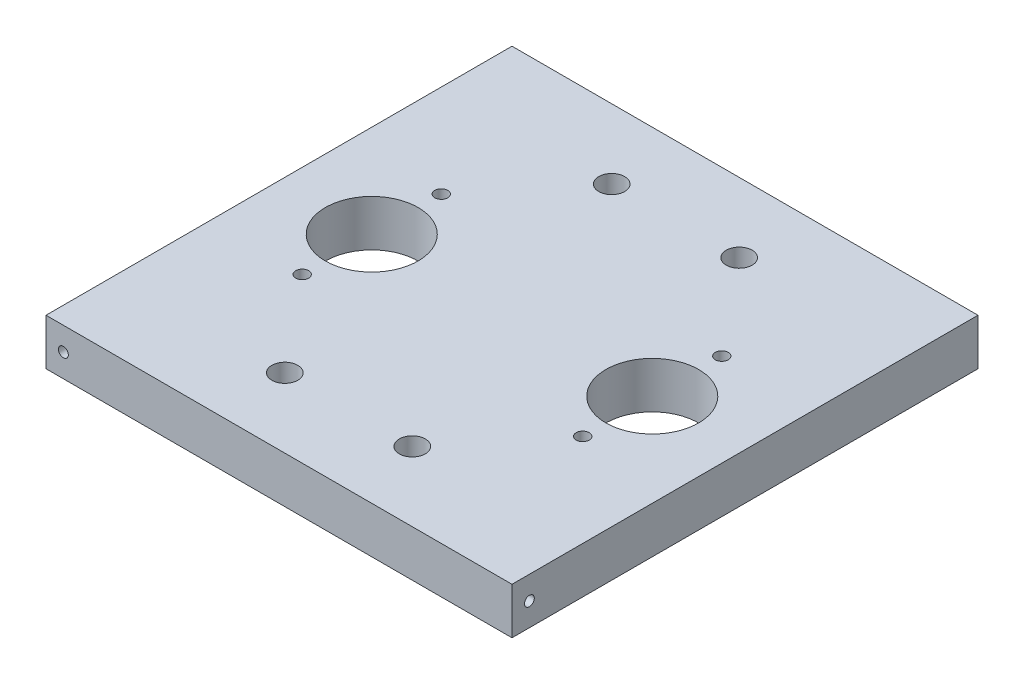
ISO-10303-21;
HEADER;
FILE_DESCRIPTION(('STEP AP214'),'2;1');
FILE_NAME('part.step','',(''),(''),'','','');
FILE_SCHEMA(('AUTOMOTIVE_DESIGN { 1 0 10303 214 1 1 1 1 }'));
ENDSEC;
DATA;
#1=APPLICATION_CONTEXT('core data for automotive mechanical design processes');
#2=APPLICATION_PROTOCOL_DEFINITION('international standard','automotive_design',2000,#1);
#3=PRODUCT_CONTEXT('',#1,'mechanical');
#4=PRODUCT('Part','Part','',(#3));
#5=PRODUCT_RELATED_PRODUCT_CATEGORY('part','',(#4));
#6=PRODUCT_DEFINITION_FORMATION('','',#4);
#7=PRODUCT_DEFINITION_CONTEXT('part definition',#1,'design');
#8=PRODUCT_DEFINITION('design','',#6,#7);
#9=PRODUCT_DEFINITION_SHAPE('','',#8);
#10=(LENGTH_UNIT() NAMED_UNIT(*) SI_UNIT(.MILLI.,.METRE.));
#11=(NAMED_UNIT(*) PLANE_ANGLE_UNIT() SI_UNIT($,.RADIAN.));
#12=(NAMED_UNIT(*) SI_UNIT($,.STERADIAN.) SOLID_ANGLE_UNIT());
#13=UNCERTAINTY_MEASURE_WITH_UNIT(LENGTH_MEASURE(1.E-05),#10,'distance_accuracy_value','');
#14=(GEOMETRIC_REPRESENTATION_CONTEXT(3) GLOBAL_UNCERTAINTY_ASSIGNED_CONTEXT((#13)) GLOBAL_UNIT_ASSIGNED_CONTEXT((#10,
#11,#12)) REPRESENTATION_CONTEXT('',''));
#15=CARTESIAN_POINT('',(0.,0.,0.));
#16=DIRECTION('',(0.,0.,1.));
#17=DIRECTION('',(1.,0.,0.));
#18=AXIS2_PLACEMENT_3D('',#15,#16,#17);
#19=CARTESIAN_POINT('',(102.235,0.,-82.8675));
#20=DIRECTION('',(0.,1.,0.));
#21=DIRECTION('',(0.,0.,1.));
#22=AXIS2_PLACEMENT_3D('',#19,#20,#21);
#23=CYLINDRICAL_SURFACE('',#22,1.778);
#24=CARTESIAN_POINT('',(102.235,0.,-82.8675));
#25=DIRECTION('',(0.,1.,0.));
#26=DIRECTION('',(0.,0.,1.));
#27=AXIS2_PLACEMENT_3D('',#24,#25,#26);
#28=CIRCLE('',#27,1.778);
#29=CARTESIAN_POINT('',(102.235,0.,-81.0895));
#30=VERTEX_POINT('',#29);
#31=EDGE_CURVE('E52',#30,#30,#28,.T.);
#32=ORIENTED_EDGE('',*,*,#31,.F.);
#33=EDGE_LOOP('',(#32));
#34=FACE_BOUND('',#33,.T.);
#35=CARTESIAN_POINT('',(102.235,12.7,-82.8675));
#36=DIRECTION('',(0.,1.,0.));
#37=DIRECTION('',(0.,0.,1.));
#38=AXIS2_PLACEMENT_3D('',#35,#36,#37);
#39=CIRCLE('',#38,1.778);
#40=CARTESIAN_POINT('',(102.235,12.7,-81.0895));
#41=VERTEX_POINT('',#40);
#42=EDGE_CURVE('E12',#41,#41,#39,.T.);
#43=ORIENTED_EDGE('',*,*,#42,.T.);
#44=EDGE_LOOP('',(#43));
#45=FACE_BOUND('',#44,.T.);
#46=ADVANCED_FACE('F44',(#34,#45),#23,.F.);
#47=CARTESIAN_POINT('',(102.235,0.,-44.7675));
#48=DIRECTION('',(0.,1.,0.));
#49=DIRECTION('',(0.,0.,1.));
#50=AXIS2_PLACEMENT_3D('',#47,#48,#49);
#51=CYLINDRICAL_SURFACE('',#50,1.778);
#52=CARTESIAN_POINT('',(102.235,0.,-44.7675));
#53=DIRECTION('',(0.,1.,0.));
#54=DIRECTION('',(0.,0.,1.));
#55=AXIS2_PLACEMENT_3D('',#52,#53,#54);
#56=CIRCLE('',#55,1.778);
#57=CARTESIAN_POINT('',(102.235,0.,-42.9895));
#58=VERTEX_POINT('',#57);
#59=EDGE_CURVE('E182',#58,#58,#56,.T.);
#60=ORIENTED_EDGE('',*,*,#59,.F.);
#61=EDGE_LOOP('',(#60));
#62=FACE_BOUND('',#61,.T.);
#63=CARTESIAN_POINT('',(102.235,12.7,-44.7675));
#64=DIRECTION('',(0.,1.,0.));
#65=DIRECTION('',(0.,0.,1.));
#66=AXIS2_PLACEMENT_3D('',#63,#64,#65);
#67=CIRCLE('',#66,1.778);
#68=CARTESIAN_POINT('',(102.235,12.7,-42.9895));
#69=VERTEX_POINT('',#68);
#70=EDGE_CURVE('E180',#69,#69,#67,.T.);
#71=ORIENTED_EDGE('',*,*,#70,.T.);
#72=EDGE_LOOP('',(#71));
#73=FACE_BOUND('',#72,.T.);
#74=ADVANCED_FACE('F167',(#62,#73),#51,.F.);
#75=CARTESIAN_POINT('',(81.28,0.,-19.05));
#76=DIRECTION('',(0.,1.,0.));
#77=DIRECTION('',(0.,0.,1.));
#78=AXIS2_PLACEMENT_3D('',#75,#76,#77);
#79=CYLINDRICAL_SURFACE('',#78,3.55600000000001);
#80=CARTESIAN_POINT('',(81.28,0.,-19.05));
#81=DIRECTION('',(0.,1.,0.));
#82=DIRECTION('',(0.,0.,1.));
#83=AXIS2_PLACEMENT_3D('',#80,#81,#82);
#84=CIRCLE('',#83,3.55600000000001);
#85=CARTESIAN_POINT('',(81.28,0.,-15.494));
#86=VERTEX_POINT('',#85);
#87=EDGE_CURVE('E190',#86,#86,#84,.T.);
#88=ORIENTED_EDGE('',*,*,#87,.F.);
#89=EDGE_LOOP('',(#88));
#90=FACE_BOUND('',#89,.T.);
#91=CARTESIAN_POINT('',(81.28,12.7,-19.05));
#92=DIRECTION('',(0.,1.,0.));
#93=DIRECTION('',(0.,0.,1.));
#94=AXIS2_PLACEMENT_3D('',#91,#92,#93);
#95=CIRCLE('',#94,3.55600000000001);
#96=CARTESIAN_POINT('',(81.28,12.7,-15.494));
#97=VERTEX_POINT('',#96);
#98=EDGE_CURVE('E187',#97,#97,#95,.T.);
#99=ORIENTED_EDGE('',*,*,#98,.T.);
#100=EDGE_LOOP('',(#99));
#101=FACE_BOUND('',#100,.T.);
#102=ADVANCED_FACE('F172',(#90,#101),#79,.F.);
#103=CARTESIAN_POINT('',(46.355,0.,-19.05));
#104=DIRECTION('',(0.,1.,0.));
#105=DIRECTION('',(0.,0.,1.));
#106=AXIS2_PLACEMENT_3D('',#103,#104,#105);
#107=CYLINDRICAL_SURFACE('',#106,3.55600000000001);
#108=CARTESIAN_POINT('',(46.355,0.,-19.05));
#109=DIRECTION('',(0.,1.,0.));
#110=DIRECTION('',(0.,0.,1.));
#111=AXIS2_PLACEMENT_3D('',#108,#109,#110);
#112=CIRCLE('',#111,3.55600000000001);
#113=CARTESIAN_POINT('',(46.355,0.,-15.494));
#114=VERTEX_POINT('',#113);
#115=EDGE_CURVE('E196',#114,#114,#112,.T.);
#116=ORIENTED_EDGE('',*,*,#115,.F.);
#117=EDGE_LOOP('',(#116));
#118=FACE_BOUND('',#117,.T.);
#119=CARTESIAN_POINT('',(46.355,12.7,-19.05));
#120=DIRECTION('',(0.,1.,0.));
#121=DIRECTION('',(0.,0.,1.));
#122=AXIS2_PLACEMENT_3D('',#119,#120,#121);
#123=CIRCLE('',#122,3.55600000000001);
#124=CARTESIAN_POINT('',(46.355,12.7,-15.494));
#125=VERTEX_POINT('',#124);
#126=EDGE_CURVE('E193',#125,#125,#123,.T.);
#127=ORIENTED_EDGE('',*,*,#126,.T.);
#128=EDGE_LOOP('',(#127));
#129=FACE_BOUND('',#128,.T.);
#130=ADVANCED_FACE('F215',(#118,#129),#107,.F.);
#131=CARTESIAN_POINT('',(0.,12.7,0.));
#132=DIRECTION('',(1.,0.,0.));
#133=DIRECTION('',(0.,0.,-1.));
#134=AXIS2_PLACEMENT_3D('',#131,#132,#133);
#135=PLANE('',#134);
#136=CARTESIAN_POINT('',(0.,6.35,-122.8725));
#137=DIRECTION('',(-1.,0.,0.));
#138=DIRECTION('',(0.,0.,1.));
#139=AXIS2_PLACEMENT_3D('',#136,#137,#138);
#140=CIRCLE('',#139,1.35255);
#141=CARTESIAN_POINT('',(0.,6.35,-121.51995));
#142=VERTEX_POINT('',#141);
#143=EDGE_CURVE('E248',#142,#142,#140,.T.);
#144=ORIENTED_EDGE('',*,*,#143,.F.);
#145=EDGE_LOOP('',(#144));
#146=FACE_BOUND('',#145,.T.);
#147=DIRECTION('',(0.,0.,1.));
#148=VECTOR('',#147,1.);
#149=CARTESIAN_POINT('',(0.,0.,0.));
#150=LINE('',#149,#148);
#151=CARTESIAN_POINT('',(0.,0.,-127.635));
#152=VERTEX_POINT('',#151);
#153=CARTESIAN_POINT('',(0.,0.,0.));
#154=VERTEX_POINT('',#153);
#155=EDGE_CURVE('E112',#152,#154,#150,.T.);
#156=ORIENTED_EDGE('',*,*,#155,.T.);
#157=DIRECTION('',(0.,-1.,0.));
#158=VECTOR('',#157,1.);
#159=CARTESIAN_POINT('',(0.,12.7,0.));
#160=LINE('',#159,#158);
#161=CARTESIAN_POINT('',(0.,12.7,0.));
#162=VERTEX_POINT('',#161);
#163=EDGE_CURVE('E103',#162,#154,#160,.T.);
#164=ORIENTED_EDGE('',*,*,#163,.F.);
#165=DIRECTION('',(0.,0.,1.));
#166=VECTOR('',#165,1.);
#167=CARTESIAN_POINT('',(0.,12.7,0.));
#168=LINE('',#167,#166);
#169=CARTESIAN_POINT('',(0.,12.7,-127.635));
#170=VERTEX_POINT('',#169);
#171=EDGE_CURVE('E97',#170,#162,#168,.T.);
#172=ORIENTED_EDGE('',*,*,#171,.F.);
#173=DIRECTION('',(0.,-1.,0.));
#174=VECTOR('',#173,1.);
#175=CARTESIAN_POINT('',(0.,12.7,-127.635));
#176=LINE('',#175,#174);
#177=EDGE_CURVE('E108',#170,#152,#176,.T.);
#178=ORIENTED_EDGE('',*,*,#177,.T.);
#179=EDGE_LOOP('',(#156,#164,#172,#178));
#180=FACE_BOUND('',#179,.T.);
#181=ADVANCED_FACE('F201',(#146,#180),#135,.F.);
#182=CARTESIAN_POINT('',(0.,12.7,0.));
#183=DIRECTION('',(0.,0.,-1.));
#184=DIRECTION('',(-1.,0.,0.));
#185=AXIS2_PLACEMENT_3D('',#182,#183,#184);
#186=PLANE('',#185);
#187=CARTESIAN_POINT('',(4.7625,6.35,0.));
#188=DIRECTION('',(0.,0.,1.));
#189=DIRECTION('',(1.,0.,0.));
#190=AXIS2_PLACEMENT_3D('',#187,#188,#189);
#191=CIRCLE('',#190,1.35255);
#192=CARTESIAN_POINT('',(6.11505,6.35,0.));
#193=VERTEX_POINT('',#192);
#194=EDGE_CURVE('E254',#193,#193,#191,.T.);
#195=ORIENTED_EDGE('',*,*,#194,.F.);
#196=EDGE_LOOP('',(#195));
#197=FACE_BOUND('',#196,.T.);
#198=DIRECTION('',(1.,0.,0.));
#199=VECTOR('',#198,1.);
#200=CARTESIAN_POINT('',(0.,0.,0.));
#201=LINE('',#200,#199);
#202=CARTESIAN_POINT('',(127.635,0.,0.));
#203=VERTEX_POINT('',#202);
#204=EDGE_CURVE('E102',#154,#203,#201,.T.);
#205=ORIENTED_EDGE('',*,*,#204,.T.);
#206=DIRECTION('',(0.,-1.,0.));
#207=VECTOR('',#206,1.);
#208=CARTESIAN_POINT('',(127.635,12.7,0.));
#209=LINE('',#208,#207);
#210=CARTESIAN_POINT('',(127.635,12.7,0.));
#211=VERTEX_POINT('',#210);
#212=EDGE_CURVE('E100',#211,#203,#209,.T.);
#213=ORIENTED_EDGE('',*,*,#212,.F.);
#214=DIRECTION('',(1.,0.,0.));
#215=VECTOR('',#214,1.);
#216=CARTESIAN_POINT('',(0.,12.7,0.));
#217=LINE('',#216,#215);
#218=EDGE_CURVE('E91',#162,#211,#217,.T.);
#219=ORIENTED_EDGE('',*,*,#218,.F.);
#220=ORIENTED_EDGE('',*,*,#163,.T.);
#221=EDGE_LOOP('',(#205,#213,#219,#220));
#222=FACE_BOUND('',#221,.T.);
#223=ADVANCED_FACE('F101',(#197,#222),#186,.F.);
#224=CARTESIAN_POINT('',(127.635,12.7,0.));
#225=DIRECTION('',(-1.,0.,0.));
#226=DIRECTION('',(0.,0.,1.));
#227=AXIS2_PLACEMENT_3D('',#224,#225,#226);
#228=PLANE('',#227);
#229=CARTESIAN_POINT('',(127.635,6.35,-4.7625));
#230=DIRECTION('',(1.,0.,0.));
#231=DIRECTION('',(0.,0.,-1.));
#232=AXIS2_PLACEMENT_3D('',#229,#230,#231);
#233=CIRCLE('',#232,1.35255);
#234=CARTESIAN_POINT('',(127.635,6.35,-6.11505));
#235=VERTEX_POINT('',#234);
#236=EDGE_CURVE('E237',#235,#235,#233,.T.);
#237=ORIENTED_EDGE('',*,*,#236,.F.);
#238=EDGE_LOOP('',(#237));
#239=FACE_BOUND('',#238,.T.);
#240=DIRECTION('',(0.,0.,-1.));
#241=VECTOR('',#240,1.);
#242=CARTESIAN_POINT('',(127.635,0.,0.));
#243=LINE('',#242,#241);
#244=CARTESIAN_POINT('',(127.635,0.,-127.635));
#245=VERTEX_POINT('',#244);
#246=EDGE_CURVE('E77',#203,#245,#243,.T.);
#247=ORIENTED_EDGE('',*,*,#246,.T.);
#248=DIRECTION('',(0.,-1.,0.));
#249=VECTOR('',#248,1.);
#250=CARTESIAN_POINT('',(127.635,12.7,-127.635));
#251=LINE('',#250,#249);
#252=CARTESIAN_POINT('',(127.635,12.7,-127.635));
#253=VERTEX_POINT('',#252);
#254=EDGE_CURVE('E104',#253,#245,#251,.T.);
#255=ORIENTED_EDGE('',*,*,#254,.F.);
#256=DIRECTION('',(0.,0.,-1.));
#257=VECTOR('',#256,1.);
#258=CARTESIAN_POINT('',(127.635,12.7,0.));
#259=LINE('',#258,#257);
#260=EDGE_CURVE('E95',#211,#253,#259,.T.);
#261=ORIENTED_EDGE('',*,*,#260,.F.);
#262=ORIENTED_EDGE('',*,*,#212,.T.);
#263=EDGE_LOOP('',(#247,#255,#261,#262));
#264=FACE_BOUND('',#263,.T.);
#265=ADVANCED_FACE('F106',(#239,#264),#228,.F.);
#266=CARTESIAN_POINT('',(0.,12.7,-127.635));
#267=DIRECTION('',(0.,0.,1.));
#268=DIRECTION('',(1.,0.,0.));
#269=AXIS2_PLACEMENT_3D('',#266,#267,#268);
#270=PLANE('',#269);
#271=CARTESIAN_POINT('',(122.8725,6.35,-127.635));
#272=DIRECTION('',(0.,0.,-1.));
#273=DIRECTION('',(-1.,0.,0.));
#274=AXIS2_PLACEMENT_3D('',#271,#272,#273);
#275=CIRCLE('',#274,1.35255000000001);
#276=CARTESIAN_POINT('',(121.51995,6.35,-127.635));
#277=VERTEX_POINT('',#276);
#278=EDGE_CURVE('E242',#277,#277,#275,.T.);
#279=ORIENTED_EDGE('',*,*,#278,.F.);
#280=EDGE_LOOP('',(#279));
#281=FACE_BOUND('',#280,.T.);
#282=DIRECTION('',(-1.,0.,0.));
#283=VECTOR('',#282,1.);
#284=CARTESIAN_POINT('',(0.,0.,-127.635));
#285=LINE('',#284,#283);
#286=EDGE_CURVE('E83',#245,#152,#285,.T.);
#287=ORIENTED_EDGE('',*,*,#286,.T.);
#288=ORIENTED_EDGE('',*,*,#177,.F.);
#289=DIRECTION('',(-1.,0.,0.));
#290=VECTOR('',#289,1.);
#291=CARTESIAN_POINT('',(0.,12.7,-127.635));
#292=LINE('',#291,#290);
#293=EDGE_CURVE('E60',#253,#170,#292,.T.);
#294=ORIENTED_EDGE('',*,*,#293,.F.);
#295=ORIENTED_EDGE('',*,*,#254,.T.);
#296=EDGE_LOOP('',(#287,#288,#294,#295));
#297=FACE_BOUND('',#296,.T.);
#298=ADVANCED_FACE('F152',(#281,#297),#270,.F.);
#299=CARTESIAN_POINT('',(0.,12.7,0.));
#300=DIRECTION('',(0.,-1.,0.));
#301=DIRECTION('',(0.,0.,-1.));
#302=AXIS2_PLACEMENT_3D('',#299,#300,#301);
#303=PLANE('',#302);
#304=CARTESIAN_POINT('',(102.235,12.7,-63.8175));
#305=DIRECTION('',(0.,1.,0.));
#306=DIRECTION('',(0.,0.,1.));
#307=AXIS2_PLACEMENT_3D('',#304,#305,#306);
#308=CIRCLE('',#307,12.7);
#309=CARTESIAN_POINT('',(102.235,12.7,-51.1175));
#310=VERTEX_POINT('',#309);
#311=EDGE_CURVE('E260',#310,#310,#308,.T.);
#312=ORIENTED_EDGE('',*,*,#311,.F.);
#313=EDGE_LOOP('',(#312));
#314=FACE_BOUND('',#313,.T.);
#315=CARTESIAN_POINT('',(25.4,12.7,-63.8175));
#316=DIRECTION('',(0.,1.,0.));
#317=DIRECTION('',(0.,0.,1.));
#318=AXIS2_PLACEMENT_3D('',#315,#316,#317);
#319=CIRCLE('',#318,12.7);
#320=CARTESIAN_POINT('',(25.4,12.7,-51.1175));
#321=VERTEX_POINT('',#320);
#322=EDGE_CURVE('E266',#321,#321,#319,.T.);
#323=ORIENTED_EDGE('',*,*,#322,.F.);
#324=EDGE_LOOP('',(#323));
#325=FACE_BOUND('',#324,.T.);
#326=CARTESIAN_POINT('',(25.4,12.7,-82.8675));
#327=DIRECTION('',(0.,1.,0.));
#328=DIRECTION('',(0.,0.,1.));
#329=AXIS2_PLACEMENT_3D('',#326,#327,#328);
#330=CIRCLE('',#329,1.778);
#331=CARTESIAN_POINT('',(25.4,12.7,-81.0895));
#332=VERTEX_POINT('',#331);
#333=EDGE_CURVE('E277',#332,#332,#330,.T.);
#334=ORIENTED_EDGE('',*,*,#333,.F.);
#335=EDGE_LOOP('',(#334));
#336=FACE_BOUND('',#335,.T.);
#337=CARTESIAN_POINT('',(25.4,12.7,-44.7675));
#338=DIRECTION('',(0.,1.,0.));
#339=DIRECTION('',(0.,0.,1.));
#340=AXIS2_PLACEMENT_3D('',#337,#338,#339);
#341=CIRCLE('',#340,1.778);
#342=CARTESIAN_POINT('',(25.4,12.7,-42.9895));
#343=VERTEX_POINT('',#342);
#344=EDGE_CURVE('E137',#343,#343,#341,.T.);
#345=ORIENTED_EDGE('',*,*,#344,.F.);
#346=EDGE_LOOP('',(#345));
#347=FACE_BOUND('',#346,.T.);
#348=CARTESIAN_POINT('',(81.28,12.7,-108.585));
#349=DIRECTION('',(0.,1.,0.));
#350=DIRECTION('',(0.,0.,1.));
#351=AXIS2_PLACEMENT_3D('',#348,#349,#350);
#352=CIRCLE('',#351,3.55600000000001);
#353=CARTESIAN_POINT('',(81.28,12.7,-105.029));
#354=VERTEX_POINT('',#353);
#355=EDGE_CURVE('E135',#354,#354,#352,.T.);
#356=ORIENTED_EDGE('',*,*,#355,.F.);
#357=EDGE_LOOP('',(#356));
#358=FACE_BOUND('',#357,.T.);
#359=CARTESIAN_POINT('',(46.355,12.7,-108.585));
#360=DIRECTION('',(0.,1.,0.));
#361=DIRECTION('',(0.,0.,1.));
#362=AXIS2_PLACEMENT_3D('',#359,#360,#361);
#363=CIRCLE('',#362,3.55600000000001);
#364=CARTESIAN_POINT('',(46.355,12.7,-105.029));
#365=VERTEX_POINT('',#364);
#366=EDGE_CURVE('E140',#365,#365,#363,.T.);
#367=ORIENTED_EDGE('',*,*,#366,.F.);
#368=EDGE_LOOP('',(#367));
#369=FACE_BOUND('',#368,.T.);
#370=ORIENTED_EDGE('',*,*,#171,.T.);
#371=ORIENTED_EDGE('',*,*,#218,.T.);
#372=ORIENTED_EDGE('',*,*,#260,.T.);
#373=ORIENTED_EDGE('',*,*,#293,.T.);
#374=EDGE_LOOP('',(#370,#371,#372,#373));
#375=FACE_BOUND('',#374,.T.);
#376=ORIENTED_EDGE('',*,*,#126,.F.);
#377=EDGE_LOOP('',(#376));
#378=FACE_BOUND('',#377,.T.);
#379=ORIENTED_EDGE('',*,*,#98,.F.);
#380=EDGE_LOOP('',(#379));
#381=FACE_BOUND('',#380,.T.);
#382=ORIENTED_EDGE('',*,*,#70,.F.);
#383=EDGE_LOOP('',(#382));
#384=FACE_BOUND('',#383,.T.);
#385=ORIENTED_EDGE('',*,*,#42,.F.);
#386=EDGE_LOOP('',(#385));
#387=FACE_BOUND('',#386,.T.);
#388=ADVANCED_FACE('F92',(#314,#325,#336,#347,#358,#369,#375,#378,#381,#384,#387),#303,.F.);
#389=CARTESIAN_POINT('',(0.,0.,0.));
#390=DIRECTION('',(0.,-1.,0.));
#391=DIRECTION('',(0.,0.,-1.));
#392=AXIS2_PLACEMENT_3D('',#389,#390,#391);
#393=PLANE('',#392);
#394=CARTESIAN_POINT('',(102.235,0.,-63.8175));
#395=DIRECTION('',(0.,1.,0.));
#396=DIRECTION('',(0.,0.,1.));
#397=AXIS2_PLACEMENT_3D('',#394,#395,#396);
#398=CIRCLE('',#397,12.7);
#399=CARTESIAN_POINT('',(102.235,0.,-51.1175));
#400=VERTEX_POINT('',#399);
#401=EDGE_CURVE('E263',#400,#400,#398,.T.);
#402=ORIENTED_EDGE('',*,*,#401,.T.);
#403=EDGE_LOOP('',(#402));
#404=FACE_BOUND('',#403,.T.);
#405=CARTESIAN_POINT('',(25.4,0.,-63.8175));
#406=DIRECTION('',(0.,1.,0.));
#407=DIRECTION('',(0.,0.,1.));
#408=AXIS2_PLACEMENT_3D('',#405,#406,#407);
#409=CIRCLE('',#408,12.7);
#410=CARTESIAN_POINT('',(25.4,0.,-51.1175));
#411=VERTEX_POINT('',#410);
#412=EDGE_CURVE('E269',#411,#411,#409,.T.);
#413=ORIENTED_EDGE('',*,*,#412,.T.);
#414=EDGE_LOOP('',(#413));
#415=FACE_BOUND('',#414,.T.);
#416=CARTESIAN_POINT('',(25.4,0.,-82.8675));
#417=DIRECTION('',(0.,1.,0.));
#418=DIRECTION('',(0.,0.,1.));
#419=AXIS2_PLACEMENT_3D('',#416,#417,#418);
#420=CIRCLE('',#419,1.778);
#421=CARTESIAN_POINT('',(25.4,0.,-81.0895));
#422=VERTEX_POINT('',#421);
#423=EDGE_CURVE('E272',#422,#422,#420,.T.);
#424=ORIENTED_EDGE('',*,*,#423,.T.);
#425=EDGE_LOOP('',(#424));
#426=FACE_BOUND('',#425,.T.);
#427=CARTESIAN_POINT('',(25.4,0.,-44.7675));
#428=DIRECTION('',(0.,1.,0.));
#429=DIRECTION('',(0.,0.,1.));
#430=AXIS2_PLACEMENT_3D('',#427,#428,#429);
#431=CIRCLE('',#430,1.778);
#432=CARTESIAN_POINT('',(25.4,0.,-42.9895));
#433=VERTEX_POINT('',#432);
#434=EDGE_CURVE('E136',#433,#433,#431,.T.);
#435=ORIENTED_EDGE('',*,*,#434,.T.);
#436=EDGE_LOOP('',(#435));
#437=FACE_BOUND('',#436,.T.);
#438=CARTESIAN_POINT('',(81.28,0.,-108.585));
#439=DIRECTION('',(0.,1.,0.));
#440=DIRECTION('',(0.,0.,1.));
#441=AXIS2_PLACEMENT_3D('',#438,#439,#440);
#442=CIRCLE('',#441,3.55600000000001);
#443=CARTESIAN_POINT('',(81.28,0.,-105.029));
#444=VERTEX_POINT('',#443);
#445=EDGE_CURVE('E129',#444,#444,#442,.T.);
#446=ORIENTED_EDGE('',*,*,#445,.T.);
#447=EDGE_LOOP('',(#446));
#448=FACE_BOUND('',#447,.T.);
#449=CARTESIAN_POINT('',(46.355,0.,-108.585));
#450=DIRECTION('',(0.,1.,0.));
#451=DIRECTION('',(0.,0.,1.));
#452=AXIS2_PLACEMENT_3D('',#449,#450,#451);
#453=CIRCLE('',#452,3.55600000000001);
#454=CARTESIAN_POINT('',(46.355,0.,-105.029));
#455=VERTEX_POINT('',#454);
#456=EDGE_CURVE('E115',#455,#455,#453,.T.);
#457=ORIENTED_EDGE('',*,*,#456,.T.);
#458=EDGE_LOOP('',(#457));
#459=FACE_BOUND('',#458,.T.);
#460=ORIENTED_EDGE('',*,*,#155,.F.);
#461=ORIENTED_EDGE('',*,*,#286,.F.);
#462=ORIENTED_EDGE('',*,*,#246,.F.);
#463=ORIENTED_EDGE('',*,*,#204,.F.);
#464=EDGE_LOOP('',(#460,#461,#462,#463));
#465=FACE_BOUND('',#464,.T.);
#466=ORIENTED_EDGE('',*,*,#115,.T.);
#467=EDGE_LOOP('',(#466));
#468=FACE_BOUND('',#467,.T.);
#469=ORIENTED_EDGE('',*,*,#87,.T.);
#470=EDGE_LOOP('',(#469));
#471=FACE_BOUND('',#470,.T.);
#472=ORIENTED_EDGE('',*,*,#59,.T.);
#473=EDGE_LOOP('',(#472));
#474=FACE_BOUND('',#473,.T.);
#475=ORIENTED_EDGE('',*,*,#31,.T.);
#476=EDGE_LOOP('',(#475));
#477=FACE_BOUND('',#476,.T.);
#478=ADVANCED_FACE('F151',(#404,#415,#426,#437,#448,#459,#465,#468,#471,#474,#477),#393,.T.);
#479=CARTESIAN_POINT('',(46.355,0.,-108.585));
#480=DIRECTION('',(0.,1.,0.));
#481=DIRECTION('',(0.,0.,1.));
#482=AXIS2_PLACEMENT_3D('',#479,#480,#481);
#483=CYLINDRICAL_SURFACE('',#482,3.55600000000001);
#484=ORIENTED_EDGE('',*,*,#456,.F.);
#485=EDGE_LOOP('',(#484));
#486=FACE_BOUND('',#485,.T.);
#487=ORIENTED_EDGE('',*,*,#366,.T.);
#488=EDGE_LOOP('',(#487));
#489=FACE_BOUND('',#488,.T.);
#490=ADVANCED_FACE('F148',(#486,#489),#483,.F.);
#491=CARTESIAN_POINT('',(81.28,0.,-108.585));
#492=DIRECTION('',(0.,1.,0.));
#493=DIRECTION('',(0.,0.,1.));
#494=AXIS2_PLACEMENT_3D('',#491,#492,#493);
#495=CYLINDRICAL_SURFACE('',#494,3.55600000000001);
#496=ORIENTED_EDGE('',*,*,#445,.F.);
#497=EDGE_LOOP('',(#496));
#498=FACE_BOUND('',#497,.T.);
#499=ORIENTED_EDGE('',*,*,#355,.T.);
#500=EDGE_LOOP('',(#499));
#501=FACE_BOUND('',#500,.T.);
#502=ADVANCED_FACE('F290',(#498,#501),#495,.F.);
#503=CARTESIAN_POINT('',(25.4,0.,-44.7675));
#504=DIRECTION('',(0.,1.,0.));
#505=DIRECTION('',(0.,0.,1.));
#506=AXIS2_PLACEMENT_3D('',#503,#504,#505);
#507=CYLINDRICAL_SURFACE('',#506,1.778);
#508=ORIENTED_EDGE('',*,*,#434,.F.);
#509=EDGE_LOOP('',(#508));
#510=FACE_BOUND('',#509,.T.);
#511=ORIENTED_EDGE('',*,*,#344,.T.);
#512=EDGE_LOOP('',(#511));
#513=FACE_BOUND('',#512,.T.);
#514=ADVANCED_FACE('F285',(#510,#513),#507,.F.);
#515=CARTESIAN_POINT('',(25.4,0.,-82.8675));
#516=DIRECTION('',(0.,1.,0.));
#517=DIRECTION('',(0.,0.,1.));
#518=AXIS2_PLACEMENT_3D('',#515,#516,#517);
#519=CYLINDRICAL_SURFACE('',#518,1.778);
#520=ORIENTED_EDGE('',*,*,#423,.F.);
#521=EDGE_LOOP('',(#520));
#522=FACE_BOUND('',#521,.T.);
#523=ORIENTED_EDGE('',*,*,#333,.T.);
#524=EDGE_LOOP('',(#523));
#525=FACE_BOUND('',#524,.T.);
#526=ADVANCED_FACE('F298',(#522,#525),#519,.F.);
#527=CARTESIAN_POINT('',(25.4,0.,-63.8175));
#528=DIRECTION('',(0.,1.,0.));
#529=DIRECTION('',(0.,0.,1.));
#530=AXIS2_PLACEMENT_3D('',#527,#528,#529);
#531=CYLINDRICAL_SURFACE('',#530,12.7);
#532=ORIENTED_EDGE('',*,*,#412,.F.);
#533=EDGE_LOOP('',(#532));
#534=FACE_BOUND('',#533,.T.);
#535=ORIENTED_EDGE('',*,*,#322,.T.);
#536=EDGE_LOOP('',(#535));
#537=FACE_BOUND('',#536,.T.);
#538=ADVANCED_FACE('F306',(#534,#537),#531,.F.);
#539=CARTESIAN_POINT('',(102.235,0.,-63.8175));
#540=DIRECTION('',(0.,1.,0.));
#541=DIRECTION('',(0.,0.,1.));
#542=AXIS2_PLACEMENT_3D('',#539,#540,#541);
#543=CYLINDRICAL_SURFACE('',#542,12.7);
#544=ORIENTED_EDGE('',*,*,#401,.F.);
#545=EDGE_LOOP('',(#544));
#546=FACE_BOUND('',#545,.T.);
#547=ORIENTED_EDGE('',*,*,#311,.T.);
#548=EDGE_LOOP('',(#547));
#549=FACE_BOUND('',#548,.T.);
#550=ADVANCED_FACE('F310',(#546,#549),#543,.F.);
#551=CARTESIAN_POINT('',(4.7625,6.35,-12.7));
#552=DIRECTION('',(0.,0.,1.));
#553=DIRECTION('',(1.,0.,0.));
#554=AXIS2_PLACEMENT_3D('',#551,#552,#553);
#555=CYLINDRICAL_SURFACE('',#554,1.35255);
#556=CARTESIAN_POINT('',(4.7625,6.35,-12.7));
#557=DIRECTION('',(0.,0.,1.));
#558=DIRECTION('',(1.,0.,0.));
#559=AXIS2_PLACEMENT_3D('',#556,#557,#558);
#560=CIRCLE('',#559,1.35255);
#561=CARTESIAN_POINT('',(6.11505,6.35,-12.7));
#562=VERTEX_POINT('',#561);
#563=EDGE_CURVE('E257',#562,#562,#560,.T.);
#564=ORIENTED_EDGE('',*,*,#563,.F.);
#565=EDGE_LOOP('',(#564));
#566=FACE_BOUND('',#565,.T.);
#567=ORIENTED_EDGE('',*,*,#194,.T.);
#568=EDGE_LOOP('',(#567));
#569=FACE_BOUND('',#568,.T.);
#570=ADVANCED_FACE('F314',(#566,#569),#555,.F.);
#571=CARTESIAN_POINT('',(4.7625,6.35,-12.7));
#572=DIRECTION('',(0.,0.,1.));
#573=DIRECTION('',(1.,0.,0.));
#574=AXIS2_PLACEMENT_3D('',#571,#572,#573);
#575=PLANE('',#574);
#576=ORIENTED_EDGE('',*,*,#563,.T.);
#577=EDGE_LOOP('',(#576));
#578=FACE_BOUND('',#577,.T.);
#579=ADVANCED_FACE('F318',(#578),#575,.T.);
#580=CARTESIAN_POINT('',(12.7,6.35,-122.8725));
#581=DIRECTION('',(-1.,0.,0.));
#582=DIRECTION('',(0.,0.,1.));
#583=AXIS2_PLACEMENT_3D('',#580,#581,#582);
#584=CYLINDRICAL_SURFACE('',#583,1.35255);
#585=CARTESIAN_POINT('',(12.7,6.35,-122.8725));
#586=DIRECTION('',(-1.,0.,0.));
#587=DIRECTION('',(0.,0.,1.));
#588=AXIS2_PLACEMENT_3D('',#585,#586,#587);
#589=CIRCLE('',#588,1.35255);
#590=CARTESIAN_POINT('',(12.7,6.35,-121.51995));
#591=VERTEX_POINT('',#590);
#592=EDGE_CURVE('E251',#591,#591,#589,.T.);
#593=ORIENTED_EDGE('',*,*,#592,.F.);
#594=EDGE_LOOP('',(#593));
#595=FACE_BOUND('',#594,.T.);
#596=ORIENTED_EDGE('',*,*,#143,.T.);
#597=EDGE_LOOP('',(#596));
#598=FACE_BOUND('',#597,.T.);
#599=ADVANCED_FACE('F322',(#595,#598),#584,.F.);
#600=CARTESIAN_POINT('',(12.7,6.35,-122.8725));
#601=DIRECTION('',(-1.,0.,0.));
#602=DIRECTION('',(0.,0.,1.));
#603=AXIS2_PLACEMENT_3D('',#600,#601,#602);
#604=PLANE('',#603);
#605=ORIENTED_EDGE('',*,*,#592,.T.);
#606=EDGE_LOOP('',(#605));
#607=FACE_BOUND('',#606,.T.);
#608=ADVANCED_FACE('F326',(#607),#604,.T.);
#609=CARTESIAN_POINT('',(122.8725,6.35,-114.935));
#610=DIRECTION('',(0.,0.,-1.));
#611=DIRECTION('',(-1.,0.,0.));
#612=AXIS2_PLACEMENT_3D('',#609,#610,#611);
#613=CYLINDRICAL_SURFACE('',#612,1.35255000000001);
#614=CARTESIAN_POINT('',(122.8725,6.35,-114.935));
#615=DIRECTION('',(0.,0.,-1.));
#616=DIRECTION('',(-1.,0.,0.));
#617=AXIS2_PLACEMENT_3D('',#614,#615,#616);
#618=CIRCLE('',#617,1.35255000000001);
#619=CARTESIAN_POINT('',(121.51995,6.35,-114.935));
#620=VERTEX_POINT('',#619);
#621=EDGE_CURVE('E245',#620,#620,#618,.T.);
#622=ORIENTED_EDGE('',*,*,#621,.F.);
#623=EDGE_LOOP('',(#622));
#624=FACE_BOUND('',#623,.T.);
#625=ORIENTED_EDGE('',*,*,#278,.T.);
#626=EDGE_LOOP('',(#625));
#627=FACE_BOUND('',#626,.T.);
#628=ADVANCED_FACE('F330',(#624,#627),#613,.F.);
#629=CARTESIAN_POINT('',(122.8725,6.35,-114.935));
#630=DIRECTION('',(0.,0.,-1.));
#631=DIRECTION('',(-1.,0.,0.));
#632=AXIS2_PLACEMENT_3D('',#629,#630,#631);
#633=PLANE('',#632);
#634=ORIENTED_EDGE('',*,*,#621,.T.);
#635=EDGE_LOOP('',(#634));
#636=FACE_BOUND('',#635,.T.);
#637=ADVANCED_FACE('F334',(#636),#633,.T.);
#638=CARTESIAN_POINT('',(114.935,6.35,-4.7625));
#639=DIRECTION('',(1.,0.,0.));
#640=DIRECTION('',(0.,0.,-1.));
#641=AXIS2_PLACEMENT_3D('',#638,#639,#640);
#642=CYLINDRICAL_SURFACE('',#641,1.35255);
#643=CARTESIAN_POINT('',(114.935,6.35,-4.7625));
#644=DIRECTION('',(1.,0.,0.));
#645=DIRECTION('',(0.,0.,-1.));
#646=AXIS2_PLACEMENT_3D('',#643,#644,#645);
#647=CIRCLE('',#646,1.35255);
#648=CARTESIAN_POINT('',(114.935,6.35,-6.11505));
#649=VERTEX_POINT('',#648);
#650=EDGE_CURVE('E239',#649,#649,#647,.T.);
#651=ORIENTED_EDGE('',*,*,#650,.F.);
#652=EDGE_LOOP('',(#651));
#653=FACE_BOUND('',#652,.T.);
#654=ORIENTED_EDGE('',*,*,#236,.T.);
#655=EDGE_LOOP('',(#654));
#656=FACE_BOUND('',#655,.T.);
#657=ADVANCED_FACE('F338',(#653,#656),#642,.F.);
#658=CARTESIAN_POINT('',(114.935,6.35,-4.7625));
#659=DIRECTION('',(1.,0.,0.));
#660=DIRECTION('',(0.,0.,-1.));
#661=AXIS2_PLACEMENT_3D('',#658,#659,#660);
#662=PLANE('',#661);
#663=ORIENTED_EDGE('',*,*,#650,.T.);
#664=EDGE_LOOP('',(#663));
#665=FACE_BOUND('',#664,.T.);
#666=ADVANCED_FACE('F342',(#665),#662,.T.);
#667=CLOSED_SHELL('',(#46,#74,#102,#130,#181,#223,#265,#298,#388,#478,#490,#502,#514,#526,#538,
#550,#570,#579,#599,#608,#628,#637,#657,#666));
#668=MANIFOLD_SOLID_BREP('B2',#667);
#669=ADVANCED_BREP_SHAPE_REPRESENTATION('',(#18,#668),#14);
#670=SHAPE_DEFINITION_REPRESENTATION(#9,#669);
ENDSEC;
END-ISO-10303-21;
